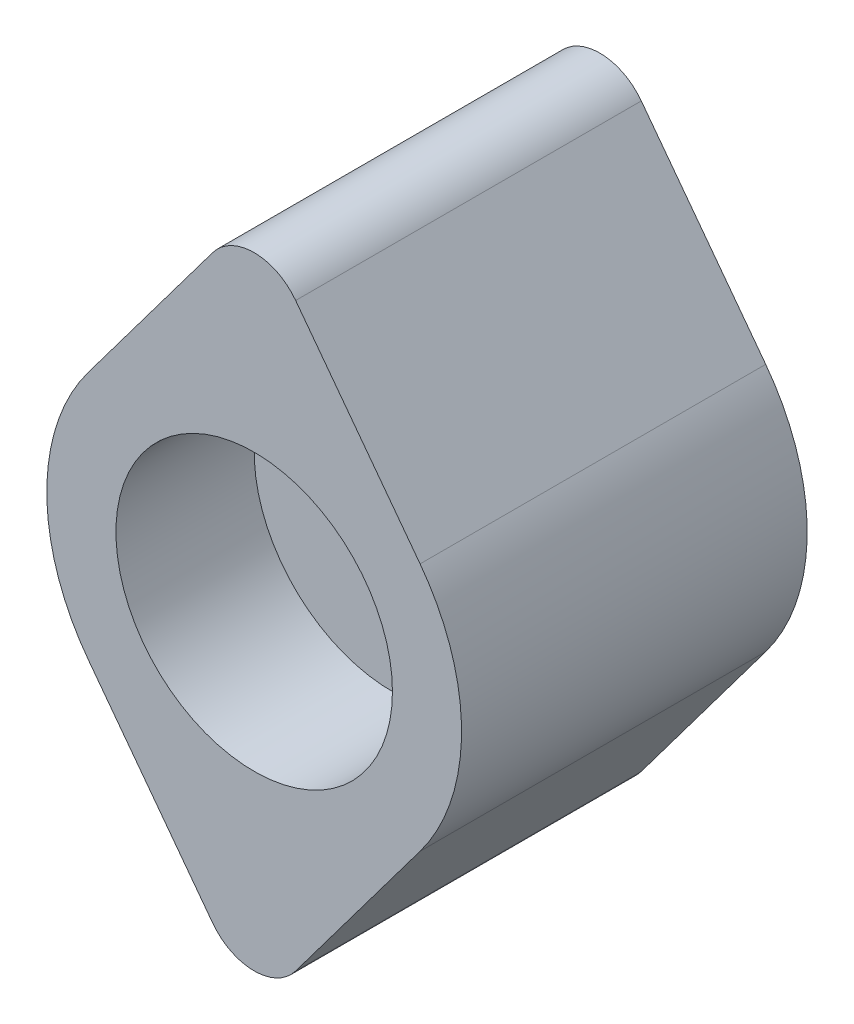
ISO-10303-21;
HEADER;
FILE_DESCRIPTION(('STEP AP214'),'2;1');
FILE_NAME('part.step','',(''),(''),'','','');
FILE_SCHEMA(('AUTOMOTIVE_DESIGN { 1 0 10303 214 1 1 1 1 }'));
ENDSEC;
DATA;
#1=APPLICATION_CONTEXT('core data for automotive mechanical design processes');
#2=APPLICATION_PROTOCOL_DEFINITION('international standard','automotive_design',2000,#1);
#3=PRODUCT_CONTEXT('',#1,'mechanical');
#4=PRODUCT('Part','Part','',(#3));
#5=PRODUCT_RELATED_PRODUCT_CATEGORY('part','',(#4));
#6=PRODUCT_DEFINITION_FORMATION('','',#4);
#7=PRODUCT_DEFINITION_CONTEXT('part definition',#1,'design');
#8=PRODUCT_DEFINITION('design','',#6,#7);
#9=PRODUCT_DEFINITION_SHAPE('','',#8);
#10=(LENGTH_UNIT() NAMED_UNIT(*) SI_UNIT(.MILLI.,.METRE.));
#11=(NAMED_UNIT(*) PLANE_ANGLE_UNIT() SI_UNIT($,.RADIAN.));
#12=(NAMED_UNIT(*) SI_UNIT($,.STERADIAN.) SOLID_ANGLE_UNIT());
#13=UNCERTAINTY_MEASURE_WITH_UNIT(LENGTH_MEASURE(1.E-05),#10,'distance_accuracy_value','');
#14=(GEOMETRIC_REPRESENTATION_CONTEXT(3) GLOBAL_UNCERTAINTY_ASSIGNED_CONTEXT((#13)) GLOBAL_UNIT_ASSIGNED_CONTEXT((#10,
#11,#12)) REPRESENTATION_CONTEXT('',''));
#15=CARTESIAN_POINT('',(0.,0.,0.));
#16=DIRECTION('',(0.,0.,1.));
#17=DIRECTION('',(1.,0.,0.));
#18=AXIS2_PLACEMENT_3D('',#15,#16,#17);
#19=CARTESIAN_POINT('',(0.,10.,10.));
#20=DIRECTION('',(-0.8,-0.6,0.));
#21=DIRECTION('',(0.6,-0.8,0.));
#22=AXIS2_PLACEMENT_3D('',#19,#20,#21);
#23=PLANE('',#22);
#24=DIRECTION('',(-0.6,0.8,0.));
#25=VECTOR('',#24,1.);
#26=CARTESIAN_POINT('',(0.,10.,0.));
#27=LINE('',#26,#25);
#28=CARTESIAN_POINT('',(4.8,3.6,0.));
#29=VERTEX_POINT('',#28);
#30=CARTESIAN_POINT('',(1.2,8.4,0.));
#31=VERTEX_POINT('',#30);
#32=EDGE_CURVE('E135',#29,#31,#27,.T.);
#33=ORIENTED_EDGE('',*,*,#32,.T.);
#34=DIRECTION('',(0.,0.,-1.));
#35=VECTOR('',#34,1.);
#36=CARTESIAN_POINT('',(1.2,8.4,10.));
#37=LINE('',#36,#35);
#38=CARTESIAN_POINT('',(1.2,8.4,10.));
#39=VERTEX_POINT('',#38);
#40=EDGE_CURVE('E11',#31,#39,#37,.F.);
#41=ORIENTED_EDGE('',*,*,#40,.T.);
#42=DIRECTION('',(-0.6,0.8,0.));
#43=VECTOR('',#42,1.);
#44=CARTESIAN_POINT('',(0.,10.,10.));
#45=LINE('',#44,#43);
#46=CARTESIAN_POINT('',(4.8,3.6,10.));
#47=VERTEX_POINT('',#46);
#48=EDGE_CURVE('E110',#47,#39,#45,.T.);
#49=ORIENTED_EDGE('',*,*,#48,.F.);
#50=DIRECTION('',(0.,0.,-1.));
#51=VECTOR('',#50,1.);
#52=CARTESIAN_POINT('',(4.8,3.6,10.));
#53=LINE('',#52,#51);
#54=EDGE_CURVE('E134',#47,#29,#53,.T.);
#55=ORIENTED_EDGE('',*,*,#54,.T.);
#56=EDGE_LOOP('',(#33,#41,#49,#55));
#57=FACE_BOUND('',#56,.T.);
#58=ADVANCED_FACE('F38',(#57),#23,.F.);
#59=CARTESIAN_POINT('',(0.,10.,10.));
#60=DIRECTION('',(0.8,-0.6,0.));
#61=DIRECTION('',(0.6,0.8,0.));
#62=AXIS2_PLACEMENT_3D('',#59,#60,#61);
#63=PLANE('',#62);
#64=DIRECTION('',(-0.6,-0.8,0.));
#65=VECTOR('',#64,1.);
#66=CARTESIAN_POINT('',(0.,10.,10.));
#67=LINE('',#66,#65);
#68=CARTESIAN_POINT('',(-1.2,8.4,10.));
#69=VERTEX_POINT('',#68);
#70=CARTESIAN_POINT('',(-4.8,3.6,10.));
#71=VERTEX_POINT('',#70);
#72=EDGE_CURVE('E100',#69,#71,#67,.T.);
#73=ORIENTED_EDGE('',*,*,#72,.F.);
#74=DIRECTION('',(0.,0.,-1.));
#75=VECTOR('',#74,1.);
#76=CARTESIAN_POINT('',(-1.2,8.4,10.));
#77=LINE('',#76,#75);
#78=CARTESIAN_POINT('',(-1.2,8.4,0.));
#79=VERTEX_POINT('',#78);
#80=EDGE_CURVE('E46',#69,#79,#77,.T.);
#81=ORIENTED_EDGE('',*,*,#80,.T.);
#82=DIRECTION('',(-0.6,-0.8,0.));
#83=VECTOR('',#82,1.);
#84=CARTESIAN_POINT('',(0.,10.,0.));
#85=LINE('',#84,#83);
#86=CARTESIAN_POINT('',(-4.8,3.6,0.));
#87=VERTEX_POINT('',#86);
#88=EDGE_CURVE('E116',#79,#87,#85,.T.);
#89=ORIENTED_EDGE('',*,*,#88,.T.);
#90=DIRECTION('',(0.,0.,-1.));
#91=VECTOR('',#90,1.);
#92=CARTESIAN_POINT('',(-4.8,3.6,10.));
#93=LINE('',#92,#91);
#94=EDGE_CURVE('E113',#71,#87,#93,.T.);
#95=ORIENTED_EDGE('',*,*,#94,.F.);
#96=EDGE_LOOP('',(#73,#81,#89,#95));
#97=FACE_BOUND('',#96,.T.);
#98=ADVANCED_FACE('F114',(#97),#63,.F.);
#99=CARTESIAN_POINT('',(0.,0.,10.));
#100=DIRECTION('',(0.,0.,-1.));
#101=DIRECTION('',(-1.,0.,0.));
#102=AXIS2_PLACEMENT_3D('',#99,#100,#101);
#103=CYLINDRICAL_SURFACE('',#102,6.);
#104=CARTESIAN_POINT('',(0.,0.,0.));
#105=DIRECTION('',(0.,0.,1.));
#106=DIRECTION('',(1.,0.,0.));
#107=AXIS2_PLACEMENT_3D('',#104,#105,#106);
#108=CIRCLE('',#107,6.);
#109=CARTESIAN_POINT('',(-4.8,-3.6,0.));
#110=VERTEX_POINT('',#109);
#111=EDGE_CURVE('E139',#87,#110,#108,.T.);
#112=ORIENTED_EDGE('',*,*,#111,.T.);
#113=DIRECTION('',(0.,0.,-1.));
#114=VECTOR('',#113,1.);
#115=CARTESIAN_POINT('',(-4.8,-3.6,10.));
#116=LINE('',#115,#114);
#117=CARTESIAN_POINT('',(-4.8,-3.6,10.));
#118=VERTEX_POINT('',#117);
#119=EDGE_CURVE('E120',#118,#110,#116,.T.);
#120=ORIENTED_EDGE('',*,*,#119,.F.);
#121=CARTESIAN_POINT('',(0.,0.,10.));
#122=DIRECTION('',(0.,0.,1.));
#123=DIRECTION('',(1.,0.,0.));
#124=AXIS2_PLACEMENT_3D('',#121,#122,#123);
#125=CIRCLE('',#124,6.);
#126=EDGE_CURVE('E105',#71,#118,#125,.T.);
#127=ORIENTED_EDGE('',*,*,#126,.F.);
#128=ORIENTED_EDGE('',*,*,#94,.T.);
#129=EDGE_LOOP('',(#112,#120,#127,#128));
#130=FACE_BOUND('',#129,.T.);
#131=ADVANCED_FACE('F122',(#130),#103,.T.);
#132=CARTESIAN_POINT('',(0.,-10.,10.));
#133=DIRECTION('',(0.8,0.6,0.));
#134=DIRECTION('',(-0.6,0.8,0.));
#135=AXIS2_PLACEMENT_3D('',#132,#133,#134);
#136=PLANE('',#135);
#137=DIRECTION('',(0.6,-0.8,0.));
#138=VECTOR('',#137,1.);
#139=CARTESIAN_POINT('',(0.,-10.,0.));
#140=LINE('',#139,#138);
#141=CARTESIAN_POINT('',(-1.2,-8.4,0.));
#142=VERTEX_POINT('',#141);
#143=EDGE_CURVE('E141',#110,#142,#140,.T.);
#144=ORIENTED_EDGE('',*,*,#143,.T.);
#145=DIRECTION('',(0.,0.,-1.));
#146=VECTOR('',#145,1.);
#147=CARTESIAN_POINT('',(-1.2,-8.4,10.));
#148=LINE('',#147,#146);
#149=CARTESIAN_POINT('',(-1.2,-8.4,10.));
#150=VERTEX_POINT('',#149);
#151=EDGE_CURVE('E160',#142,#150,#148,.F.);
#152=ORIENTED_EDGE('',*,*,#151,.T.);
#153=DIRECTION('',(0.6,-0.8,0.));
#154=VECTOR('',#153,1.);
#155=CARTESIAN_POINT('',(0.,-10.,10.));
#156=LINE('',#155,#154);
#157=EDGE_CURVE('E125',#118,#150,#156,.T.);
#158=ORIENTED_EDGE('',*,*,#157,.F.);
#159=ORIENTED_EDGE('',*,*,#119,.T.);
#160=EDGE_LOOP('',(#144,#152,#158,#159));
#161=FACE_BOUND('',#160,.T.);
#162=ADVANCED_FACE('F171',(#161),#136,.F.);
#163=CARTESIAN_POINT('',(0.,-10.,10.));
#164=DIRECTION('',(-0.8,0.6,0.));
#165=DIRECTION('',(-0.6,-0.8,0.));
#166=AXIS2_PLACEMENT_3D('',#163,#164,#165);
#167=PLANE('',#166);
#168=DIRECTION('',(0.6,0.8,0.));
#169=VECTOR('',#168,1.);
#170=CARTESIAN_POINT('',(0.,-10.,10.));
#171=LINE('',#170,#169);
#172=CARTESIAN_POINT('',(1.2,-8.4,10.));
#173=VERTEX_POINT('',#172);
#174=CARTESIAN_POINT('',(4.8,-3.6,10.));
#175=VERTEX_POINT('',#174);
#176=EDGE_CURVE('E127',#173,#175,#171,.T.);
#177=ORIENTED_EDGE('',*,*,#176,.F.);
#178=DIRECTION('',(0.,0.,-1.));
#179=VECTOR('',#178,1.);
#180=CARTESIAN_POINT('',(1.2,-8.4,10.));
#181=LINE('',#180,#179);
#182=CARTESIAN_POINT('',(1.2,-8.4,0.));
#183=VERTEX_POINT('',#182);
#184=EDGE_CURVE('E119',#173,#183,#181,.T.);
#185=ORIENTED_EDGE('',*,*,#184,.T.);
#186=DIRECTION('',(0.6,0.8,0.));
#187=VECTOR('',#186,1.);
#188=CARTESIAN_POINT('',(0.,-10.,0.));
#189=LINE('',#188,#187);
#190=CARTESIAN_POINT('',(4.8,-3.6,0.));
#191=VERTEX_POINT('',#190);
#192=EDGE_CURVE('E144',#183,#191,#189,.T.);
#193=ORIENTED_EDGE('',*,*,#192,.T.);
#194=DIRECTION('',(0.,0.,-1.));
#195=VECTOR('',#194,1.);
#196=CARTESIAN_POINT('',(4.8,-3.6,10.));
#197=LINE('',#196,#195);
#198=EDGE_CURVE('E150',#175,#191,#197,.T.);
#199=ORIENTED_EDGE('',*,*,#198,.F.);
#200=EDGE_LOOP('',(#177,#185,#193,#199));
#201=FACE_BOUND('',#200,.T.);
#202=ADVANCED_FACE('F179',(#201),#167,.F.);
#203=CARTESIAN_POINT('',(0.,0.,10.));
#204=DIRECTION('',(0.,0.,-1.));
#205=DIRECTION('',(-1.,0.,0.));
#206=AXIS2_PLACEMENT_3D('',#203,#204,#205);
#207=CYLINDRICAL_SURFACE('',#206,6.);
#208=CARTESIAN_POINT('',(0.,0.,0.));
#209=DIRECTION('',(0.,0.,1.));
#210=DIRECTION('',(1.,0.,0.));
#211=AXIS2_PLACEMENT_3D('',#208,#209,#210);
#212=CIRCLE('',#211,6.);
#213=EDGE_CURVE('E146',#191,#29,#212,.T.);
#214=ORIENTED_EDGE('',*,*,#213,.T.);
#215=ORIENTED_EDGE('',*,*,#54,.F.);
#216=CARTESIAN_POINT('',(0.,0.,10.));
#217=DIRECTION('',(0.,0.,1.));
#218=DIRECTION('',(1.,0.,0.));
#219=AXIS2_PLACEMENT_3D('',#216,#217,#218);
#220=CIRCLE('',#219,6.);
#221=EDGE_CURVE('E132',#175,#47,#220,.T.);
#222=ORIENTED_EDGE('',*,*,#221,.F.);
#223=ORIENTED_EDGE('',*,*,#198,.T.);
#224=EDGE_LOOP('',(#214,#215,#222,#223));
#225=FACE_BOUND('',#224,.T.);
#226=ADVANCED_FACE('F184',(#225),#207,.T.);
#227=CARTESIAN_POINT('',(0.,0.,10.));
#228=DIRECTION('',(0.,0.,1.));
#229=DIRECTION('',(1.,0.,0.));
#230=AXIS2_PLACEMENT_3D('',#227,#228,#229);
#231=PLANE('',#230);
#232=CARTESIAN_POINT('',(0.,0.,10.));
#233=DIRECTION('',(0.,0.,1.));
#234=DIRECTION('',(1.,0.,0.));
#235=AXIS2_PLACEMENT_3D('',#232,#233,#234);
#236=CIRCLE('',#235,4.);
#237=CARTESIAN_POINT('',(4.,0.,10.));
#238=VERTEX_POINT('',#237);
#239=EDGE_CURVE('E187',#238,#238,#236,.T.);
#240=ORIENTED_EDGE('',*,*,#239,.F.);
#241=EDGE_LOOP('',(#240));
#242=FACE_BOUND('',#241,.T.);
#243=ORIENTED_EDGE('',*,*,#157,.T.);
#244=CARTESIAN_POINT('',(0.,-7.5,10.));
#245=DIRECTION('',(0.,0.,1.));
#246=DIRECTION('',(1.,0.,0.));
#247=AXIS2_PLACEMENT_3D('',#244,#245,#246);
#248=CIRCLE('',#247,1.5);
#249=EDGE_CURVE('E163',#150,#173,#248,.T.);
#250=ORIENTED_EDGE('',*,*,#249,.T.);
#251=ORIENTED_EDGE('',*,*,#176,.T.);
#252=ORIENTED_EDGE('',*,*,#221,.T.);
#253=ORIENTED_EDGE('',*,*,#48,.T.);
#254=CARTESIAN_POINT('',(0.,7.5,10.));
#255=DIRECTION('',(0.,0.,1.));
#256=DIRECTION('',(1.,0.,0.));
#257=AXIS2_PLACEMENT_3D('',#254,#255,#256);
#258=CIRCLE('',#257,1.5);
#259=EDGE_CURVE('E53',#39,#69,#258,.T.);
#260=ORIENTED_EDGE('',*,*,#259,.T.);
#261=ORIENTED_EDGE('',*,*,#72,.T.);
#262=ORIENTED_EDGE('',*,*,#126,.T.);
#263=EDGE_LOOP('',(#243,#250,#251,#252,#253,#260,#261,#262));
#264=FACE_BOUND('',#263,.T.);
#265=ADVANCED_FACE('F103',(#242,#264),#231,.T.);
#266=CARTESIAN_POINT('',(0.,0.,0.));
#267=DIRECTION('',(0.,0.,1.));
#268=DIRECTION('',(1.,0.,0.));
#269=AXIS2_PLACEMENT_3D('',#266,#267,#268);
#270=PLANE('',#269);
#271=CARTESIAN_POINT('',(0.,0.,0.));
#272=DIRECTION('',(0.,0.,1.));
#273=DIRECTION('',(1.,0.,0.));
#274=AXIS2_PLACEMENT_3D('',#271,#272,#273);
#275=CIRCLE('',#274,1.65);
#276=CARTESIAN_POINT('',(1.65,0.,0.));
#277=VERTEX_POINT('',#276);
#278=EDGE_CURVE('E190',#277,#277,#275,.T.);
#279=ORIENTED_EDGE('',*,*,#278,.T.);
#280=EDGE_LOOP('',(#279));
#281=FACE_BOUND('',#280,.T.);
#282=ORIENTED_EDGE('',*,*,#192,.F.);
#283=CARTESIAN_POINT('',(0.,-7.5,0.));
#284=DIRECTION('',(0.,0.,1.));
#285=DIRECTION('',(1.,0.,0.));
#286=AXIS2_PLACEMENT_3D('',#283,#284,#285);
#287=CIRCLE('',#286,1.5);
#288=EDGE_CURVE('E158',#183,#142,#287,.F.);
#289=ORIENTED_EDGE('',*,*,#288,.T.);
#290=ORIENTED_EDGE('',*,*,#143,.F.);
#291=ORIENTED_EDGE('',*,*,#111,.F.);
#292=ORIENTED_EDGE('',*,*,#88,.F.);
#293=CARTESIAN_POINT('',(0.,7.5,0.));
#294=DIRECTION('',(0.,0.,1.));
#295=DIRECTION('',(1.,0.,0.));
#296=AXIS2_PLACEMENT_3D('',#293,#294,#295);
#297=CIRCLE('',#296,1.5);
#298=EDGE_CURVE('E156',#79,#31,#297,.F.);
#299=ORIENTED_EDGE('',*,*,#298,.T.);
#300=ORIENTED_EDGE('',*,*,#32,.F.);
#301=ORIENTED_EDGE('',*,*,#213,.F.);
#302=EDGE_LOOP('',(#282,#289,#290,#291,#292,#299,#300,#301));
#303=FACE_BOUND('',#302,.T.);
#304=ADVANCED_FACE('F167',(#281,#303),#270,.F.);
#305=CARTESIAN_POINT('',(0.,0.,6.));
#306=DIRECTION('',(0.,0.,1.));
#307=DIRECTION('',(1.,0.,0.));
#308=AXIS2_PLACEMENT_3D('',#305,#306,#307);
#309=CYLINDRICAL_SURFACE('',#308,4.);
#310=CARTESIAN_POINT('',(0.,0.,6.));
#311=DIRECTION('',(0.,0.,1.));
#312=DIRECTION('',(1.,0.,0.));
#313=AXIS2_PLACEMENT_3D('',#310,#311,#312);
#314=CIRCLE('',#313,4.);
#315=CARTESIAN_POINT('',(4.,0.,6.));
#316=VERTEX_POINT('',#315);
#317=EDGE_CURVE('E137',#316,#316,#314,.T.);
#318=ORIENTED_EDGE('',*,*,#317,.F.);
#319=EDGE_LOOP('',(#318));
#320=FACE_BOUND('',#319,.T.);
#321=ORIENTED_EDGE('',*,*,#239,.T.);
#322=EDGE_LOOP('',(#321));
#323=FACE_BOUND('',#322,.T.);
#324=ADVANCED_FACE('F204',(#320,#323),#309,.F.);
#325=CARTESIAN_POINT('',(0.,0.,6.));
#326=DIRECTION('',(0.,0.,1.));
#327=DIRECTION('',(1.,0.,0.));
#328=AXIS2_PLACEMENT_3D('',#325,#326,#327);
#329=PLANE('',#328);
#330=CARTESIAN_POINT('',(0.,0.,6.));
#331=DIRECTION('',(0.,0.,1.));
#332=DIRECTION('',(1.,0.,0.));
#333=AXIS2_PLACEMENT_3D('',#330,#331,#332);
#334=CIRCLE('',#333,1.64999999999999);
#335=CARTESIAN_POINT('',(1.64999999999999,0.,6.));
#336=VERTEX_POINT('',#335);
#337=EDGE_CURVE('E195',#336,#336,#334,.T.);
#338=ORIENTED_EDGE('',*,*,#337,.F.);
#339=EDGE_LOOP('',(#338));
#340=FACE_BOUND('',#339,.T.);
#341=ORIENTED_EDGE('',*,*,#317,.T.);
#342=EDGE_LOOP('',(#341));
#343=FACE_BOUND('',#342,.T.);
#344=ADVANCED_FACE('F201',(#340,#343),#329,.T.);
#345=CARTESIAN_POINT('',(0.,0.,6.));
#346=DIRECTION('',(0.,0.,1.));
#347=DIRECTION('',(1.,0.,0.));
#348=AXIS2_PLACEMENT_3D('',#345,#346,#347);
#349=CYLINDRICAL_SURFACE('',#348,1.64999999999999);
#350=ORIENTED_EDGE('',*,*,#278,.F.);
#351=EDGE_LOOP('',(#350));
#352=FACE_BOUND('',#351,.T.);
#353=ORIENTED_EDGE('',*,*,#337,.T.);
#354=EDGE_LOOP('',(#353));
#355=FACE_BOUND('',#354,.T.);
#356=ADVANCED_FACE('F199',(#352,#355),#349,.F.);
#357=CARTESIAN_POINT('',(0.,-7.5,10.));
#358=DIRECTION('',(0.,0.,-1.));
#359=DIRECTION('',(-1.,0.,0.));
#360=AXIS2_PLACEMENT_3D('',#357,#358,#359);
#361=CYLINDRICAL_SURFACE('',#360,1.5);
#362=ORIENTED_EDGE('',*,*,#249,.F.);
#363=ORIENTED_EDGE('',*,*,#151,.F.);
#364=ORIENTED_EDGE('',*,*,#288,.F.);
#365=ORIENTED_EDGE('',*,*,#184,.F.);
#366=EDGE_LOOP('',(#362,#363,#364,#365));
#367=FACE_BOUND('',#366,.T.);
#368=ADVANCED_FACE('F177',(#367),#361,.T.);
#369=CARTESIAN_POINT('',(0.,7.5,10.));
#370=DIRECTION('',(0.,0.,-1.));
#371=DIRECTION('',(-1.,0.,0.));
#372=AXIS2_PLACEMENT_3D('',#369,#370,#371);
#373=CYLINDRICAL_SURFACE('',#372,1.5);
#374=ORIENTED_EDGE('',*,*,#259,.F.);
#375=ORIENTED_EDGE('',*,*,#40,.F.);
#376=ORIENTED_EDGE('',*,*,#298,.F.);
#377=ORIENTED_EDGE('',*,*,#80,.F.);
#378=EDGE_LOOP('',(#374,#375,#376,#377));
#379=FACE_BOUND('',#378,.T.);
#380=ADVANCED_FACE('F40',(#379),#373,.T.);
#381=CLOSED_SHELL('',(#58,#98,#131,#162,#202,#226,#265,#304,#324,#344,#356,#368,#380));
#382=MANIFOLD_SOLID_BREP('B2',#381);
#383=ADVANCED_BREP_SHAPE_REPRESENTATION('',(#18,#382),#14);
#384=SHAPE_DEFINITION_REPRESENTATION(#9,#383);
ENDSEC;
END-ISO-10303-21;
